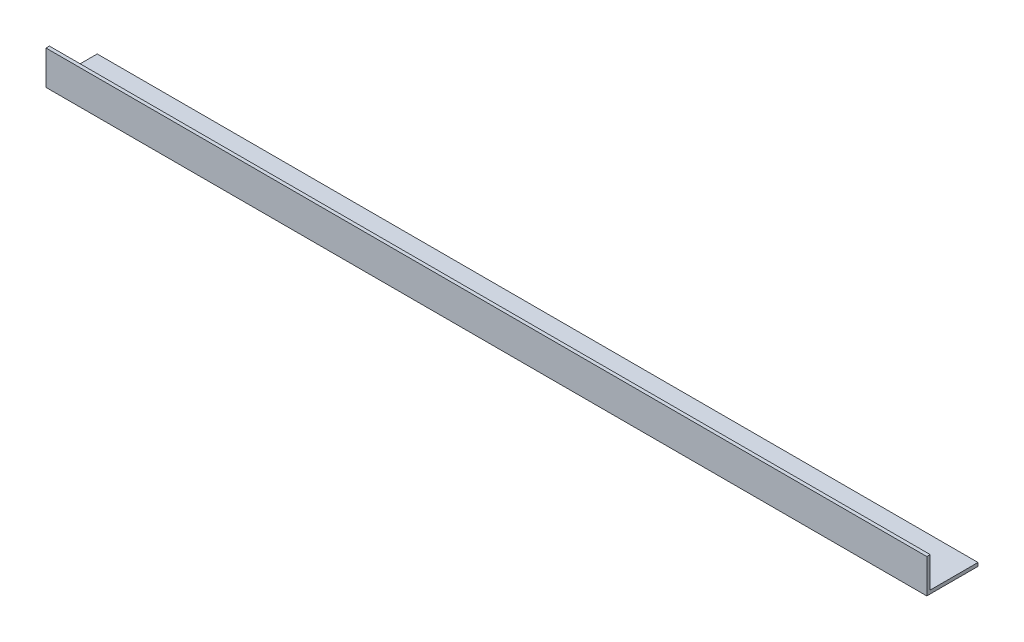
ISO-10303-21;
HEADER;
FILE_DESCRIPTION(('STEP AP214'),'2;1');
FILE_NAME('part.step','',(''),(''),'','','');
FILE_SCHEMA(('AUTOMOTIVE_DESIGN { 1 0 10303 214 1 1 1 1 }'));
ENDSEC;
DATA;
#1=APPLICATION_CONTEXT('core data for automotive mechanical design processes');
#2=APPLICATION_PROTOCOL_DEFINITION('international standard','automotive_design',2000,#1);
#3=PRODUCT_CONTEXT('',#1,'mechanical');
#4=PRODUCT('Part','Part','',(#3));
#5=PRODUCT_RELATED_PRODUCT_CATEGORY('part','',(#4));
#6=PRODUCT_DEFINITION_FORMATION('','',#4);
#7=PRODUCT_DEFINITION_CONTEXT('part definition',#1,'design');
#8=PRODUCT_DEFINITION('design','',#6,#7);
#9=PRODUCT_DEFINITION_SHAPE('','',#8);
#10=(LENGTH_UNIT() NAMED_UNIT(*) SI_UNIT(.MILLI.,.METRE.));
#11=(NAMED_UNIT(*) PLANE_ANGLE_UNIT() SI_UNIT($,.RADIAN.));
#12=(NAMED_UNIT(*) SI_UNIT($,.STERADIAN.) SOLID_ANGLE_UNIT());
#13=UNCERTAINTY_MEASURE_WITH_UNIT(LENGTH_MEASURE(1.E-05),#10,'distance_accuracy_value','');
#14=(GEOMETRIC_REPRESENTATION_CONTEXT(3) GLOBAL_UNCERTAINTY_ASSIGNED_CONTEXT((#13)) GLOBAL_UNIT_ASSIGNED_CONTEXT((#10,
#11,#12)) REPRESENTATION_CONTEXT('',''));
#15=CARTESIAN_POINT('',(0.,0.,0.));
#16=DIRECTION('',(0.,0.,1.));
#17=DIRECTION('',(1.,0.,0.));
#18=AXIS2_PLACEMENT_3D('',#15,#16,#17);
#19=CARTESIAN_POINT('',(258.,10.,-1.));
#20=DIRECTION('',(0.,-1.,0.));
#21=DIRECTION('',(0.,0.,-1.));
#22=AXIS2_PLACEMENT_3D('',#19,#20,#21);
#23=PLANE('',#22);
#24=DIRECTION('',(0.,0.,1.));
#25=VECTOR('',#24,1.);
#26=CARTESIAN_POINT('',(0.,10.,-1.));
#27=LINE('',#26,#25);
#28=CARTESIAN_POINT('',(0.,10.,-1.));
#29=VERTEX_POINT('',#28);
#30=CARTESIAN_POINT('',(0.,10.,0.));
#31=VERTEX_POINT('',#30);
#32=EDGE_CURVE('E116',#29,#31,#27,.T.);
#33=ORIENTED_EDGE('',*,*,#32,.T.);
#34=DIRECTION('',(-1.,0.,0.));
#35=VECTOR('',#34,1.);
#36=CARTESIAN_POINT('',(258.,10.,0.));
#37=LINE('',#36,#35);
#38=CARTESIAN_POINT('',(258.,10.,0.));
#39=VERTEX_POINT('',#38);
#40=EDGE_CURVE('E11',#39,#31,#37,.T.);
#41=ORIENTED_EDGE('',*,*,#40,.F.);
#42=DIRECTION('',(0.,0.,1.));
#43=VECTOR('',#42,1.);
#44=CARTESIAN_POINT('',(258.,10.,-1.));
#45=LINE('',#44,#43);
#46=CARTESIAN_POINT('',(258.,10.,-1.));
#47=VERTEX_POINT('',#46);
#48=EDGE_CURVE('E126',#47,#39,#45,.T.);
#49=ORIENTED_EDGE('',*,*,#48,.F.);
#50=DIRECTION('',(-1.,0.,0.));
#51=VECTOR('',#50,1.);
#52=CARTESIAN_POINT('',(258.,10.,-1.));
#53=LINE('',#52,#51);
#54=EDGE_CURVE('E112',#47,#29,#53,.T.);
#55=ORIENTED_EDGE('',*,*,#54,.T.);
#56=EDGE_LOOP('',(#33,#41,#49,#55));
#57=FACE_BOUND('',#56,.T.);
#58=ADVANCED_FACE('F32',(#57),#23,.F.);
#59=CARTESIAN_POINT('',(258.,10.,0.));
#60=DIRECTION('',(0.,0.,-1.));
#61=DIRECTION('',(-1.,0.,0.));
#62=AXIS2_PLACEMENT_3D('',#59,#60,#61);
#63=PLANE('',#62);
#64=DIRECTION('',(0.,-1.,0.));
#65=VECTOR('',#64,1.);
#66=CARTESIAN_POINT('',(0.,10.,0.));
#67=LINE('',#66,#65);
#68=CARTESIAN_POINT('',(0.,0.,0.));
#69=VERTEX_POINT('',#68);
#70=EDGE_CURVE('E119',#31,#69,#67,.T.);
#71=ORIENTED_EDGE('',*,*,#70,.T.);
#72=DIRECTION('',(-1.,0.,0.));
#73=VECTOR('',#72,1.);
#74=CARTESIAN_POINT('',(258.,0.,0.));
#75=LINE('',#74,#73);
#76=CARTESIAN_POINT('',(258.,0.,0.));
#77=VERTEX_POINT('',#76);
#78=EDGE_CURVE('E40',#77,#69,#75,.T.);
#79=ORIENTED_EDGE('',*,*,#78,.F.);
#80=DIRECTION('',(0.,-1.,0.));
#81=VECTOR('',#80,1.);
#82=CARTESIAN_POINT('',(258.,10.,0.));
#83=LINE('',#82,#81);
#84=EDGE_CURVE('E85',#39,#77,#83,.T.);
#85=ORIENTED_EDGE('',*,*,#84,.F.);
#86=ORIENTED_EDGE('',*,*,#40,.T.);
#87=EDGE_LOOP('',(#71,#79,#85,#86));
#88=FACE_BOUND('',#87,.T.);
#89=ADVANCED_FACE('F150',(#88),#63,.F.);
#90=CARTESIAN_POINT('',(258.,0.,0.));
#91=DIRECTION('',(0.,1.,0.));
#92=DIRECTION('',(0.,0.,1.));
#93=AXIS2_PLACEMENT_3D('',#90,#91,#92);
#94=PLANE('',#93);
#95=DIRECTION('',(0.,0.,-1.));
#96=VECTOR('',#95,1.);
#97=CARTESIAN_POINT('',(0.,0.,0.));
#98=LINE('',#97,#96);
#99=CARTESIAN_POINT('',(0.,0.,-15.));
#100=VERTEX_POINT('',#99);
#101=EDGE_CURVE('E121',#69,#100,#98,.T.);
#102=ORIENTED_EDGE('',*,*,#101,.T.);
#103=DIRECTION('',(-1.,0.,0.));
#104=VECTOR('',#103,1.);
#105=CARTESIAN_POINT('',(258.,0.,-15.));
#106=LINE('',#105,#104);
#107=CARTESIAN_POINT('',(258.,0.,-15.));
#108=VERTEX_POINT('',#107);
#109=EDGE_CURVE('E107',#108,#100,#106,.T.);
#110=ORIENTED_EDGE('',*,*,#109,.F.);
#111=DIRECTION('',(0.,0.,-1.));
#112=VECTOR('',#111,1.);
#113=CARTESIAN_POINT('',(258.,0.,0.));
#114=LINE('',#113,#112);
#115=EDGE_CURVE('E98',#77,#108,#114,.T.);
#116=ORIENTED_EDGE('',*,*,#115,.F.);
#117=ORIENTED_EDGE('',*,*,#78,.T.);
#118=EDGE_LOOP('',(#102,#110,#116,#117));
#119=FACE_BOUND('',#118,.T.);
#120=ADVANCED_FACE('F132',(#119),#94,.F.);
#121=CARTESIAN_POINT('',(258.,0.,-15.));
#122=DIRECTION('',(0.,0.,1.));
#123=DIRECTION('',(1.,0.,0.));
#124=AXIS2_PLACEMENT_3D('',#121,#122,#123);
#125=PLANE('',#124);
#126=DIRECTION('',(0.,1.,0.));
#127=VECTOR('',#126,1.);
#128=CARTESIAN_POINT('',(0.,0.,-15.));
#129=LINE('',#128,#127);
#130=CARTESIAN_POINT('',(0.,1.,-15.));
#131=VERTEX_POINT('',#130);
#132=EDGE_CURVE('E106',#100,#131,#129,.T.);
#133=ORIENTED_EDGE('',*,*,#132,.T.);
#134=DIRECTION('',(-1.,0.,0.));
#135=VECTOR('',#134,1.);
#136=CARTESIAN_POINT('',(258.,1.,-15.));
#137=LINE('',#136,#135);
#138=CARTESIAN_POINT('',(258.,1.,-15.));
#139=VERTEX_POINT('',#138);
#140=EDGE_CURVE('E103',#139,#131,#137,.T.);
#141=ORIENTED_EDGE('',*,*,#140,.F.);
#142=DIRECTION('',(0.,1.,0.));
#143=VECTOR('',#142,1.);
#144=CARTESIAN_POINT('',(258.,0.,-15.));
#145=LINE('',#144,#143);
#146=EDGE_CURVE('E92',#108,#139,#145,.T.);
#147=ORIENTED_EDGE('',*,*,#146,.F.);
#148=ORIENTED_EDGE('',*,*,#109,.T.);
#149=EDGE_LOOP('',(#133,#141,#147,#148));
#150=FACE_BOUND('',#149,.T.);
#151=ADVANCED_FACE('F104',(#150),#125,.F.);
#152=CARTESIAN_POINT('',(258.,1.,-15.));
#153=DIRECTION('',(0.,-1.,0.));
#154=DIRECTION('',(0.,0.,-1.));
#155=AXIS2_PLACEMENT_3D('',#152,#153,#154);
#156=PLANE('',#155);
#157=DIRECTION('',(0.,0.,1.));
#158=VECTOR('',#157,1.);
#159=CARTESIAN_POINT('',(0.,1.,-15.));
#160=LINE('',#159,#158);
#161=CARTESIAN_POINT('',(0.,0.999999999999998,-1.));
#162=VERTEX_POINT('',#161);
#163=EDGE_CURVE('E71',#131,#162,#160,.T.);
#164=ORIENTED_EDGE('',*,*,#163,.T.);
#165=DIRECTION('',(-1.,0.,0.));
#166=VECTOR('',#165,1.);
#167=CARTESIAN_POINT('',(258.,0.999999999999998,-1.));
#168=LINE('',#167,#166);
#169=CARTESIAN_POINT('',(258.,0.999999999999998,-1.));
#170=VERTEX_POINT('',#169);
#171=EDGE_CURVE('E108',#170,#162,#168,.T.);
#172=ORIENTED_EDGE('',*,*,#171,.F.);
#173=DIRECTION('',(0.,0.,1.));
#174=VECTOR('',#173,1.);
#175=CARTESIAN_POINT('',(258.,1.,-15.));
#176=LINE('',#175,#174);
#177=EDGE_CURVE('E96',#139,#170,#176,.T.);
#178=ORIENTED_EDGE('',*,*,#177,.F.);
#179=ORIENTED_EDGE('',*,*,#140,.T.);
#180=EDGE_LOOP('',(#164,#172,#178,#179));
#181=FACE_BOUND('',#180,.T.);
#182=ADVANCED_FACE('F110',(#181),#156,.F.);
#183=CARTESIAN_POINT('',(258.,0.999999999999998,-1.));
#184=DIRECTION('',(0.,0.,1.));
#185=DIRECTION('',(0.,-1.,0.));
#186=AXIS2_PLACEMENT_3D('',#183,#184,#185);
#187=PLANE('',#186);
#188=DIRECTION('',(0.,1.,0.));
#189=VECTOR('',#188,1.);
#190=CARTESIAN_POINT('',(0.,0.999999999999998,-1.));
#191=LINE('',#190,#189);
#192=EDGE_CURVE('E77',#162,#29,#191,.T.);
#193=ORIENTED_EDGE('',*,*,#192,.T.);
#194=ORIENTED_EDGE('',*,*,#54,.F.);
#195=DIRECTION('',(0.,1.,0.));
#196=VECTOR('',#195,1.);
#197=CARTESIAN_POINT('',(258.,0.999999999999998,-1.));
#198=LINE('',#197,#196);
#199=EDGE_CURVE('E48',#170,#47,#198,.T.);
#200=ORIENTED_EDGE('',*,*,#199,.F.);
#201=ORIENTED_EDGE('',*,*,#171,.T.);
#202=EDGE_LOOP('',(#193,#194,#200,#201));
#203=FACE_BOUND('',#202,.T.);
#204=ADVANCED_FACE('F139',(#203),#187,.F.);
#205=CARTESIAN_POINT('',(258.,0.,0.));
#206=DIRECTION('',(1.,0.,0.));
#207=DIRECTION('',(0.,0.,-1.));
#208=AXIS2_PLACEMENT_3D('',#205,#206,#207);
#209=PLANE('',#208);
#210=ORIENTED_EDGE('',*,*,#48,.T.);
#211=ORIENTED_EDGE('',*,*,#84,.T.);
#212=ORIENTED_EDGE('',*,*,#115,.T.);
#213=ORIENTED_EDGE('',*,*,#146,.T.);
#214=ORIENTED_EDGE('',*,*,#177,.T.);
#215=ORIENTED_EDGE('',*,*,#199,.T.);
#216=EDGE_LOOP('',(#210,#211,#212,#213,#214,#215));
#217=FACE_BOUND('',#216,.T.);
#218=ADVANCED_FACE('F94',(#217),#209,.T.);
#219=CARTESIAN_POINT('',(0.,0.,0.));
#220=DIRECTION('',(1.,0.,0.));
#221=DIRECTION('',(0.,0.,-1.));
#222=AXIS2_PLACEMENT_3D('',#219,#220,#221);
#223=PLANE('',#222);
#224=ORIENTED_EDGE('',*,*,#32,.F.);
#225=ORIENTED_EDGE('',*,*,#192,.F.);
#226=ORIENTED_EDGE('',*,*,#163,.F.);
#227=ORIENTED_EDGE('',*,*,#132,.F.);
#228=ORIENTED_EDGE('',*,*,#101,.F.);
#229=ORIENTED_EDGE('',*,*,#70,.F.);
#230=EDGE_LOOP('',(#224,#225,#226,#227,#228,#229));
#231=FACE_BOUND('',#230,.T.);
#232=ADVANCED_FACE('F135',(#231),#223,.F.);
#233=CLOSED_SHELL('',(#58,#89,#120,#151,#182,#204,#218,#232));
#234=MANIFOLD_SOLID_BREP('B2',#233);
#235=ADVANCED_BREP_SHAPE_REPRESENTATION('',(#18,#234),#14);
#236=SHAPE_DEFINITION_REPRESENTATION(#9,#235);
ENDSEC;
END-ISO-10303-21;
